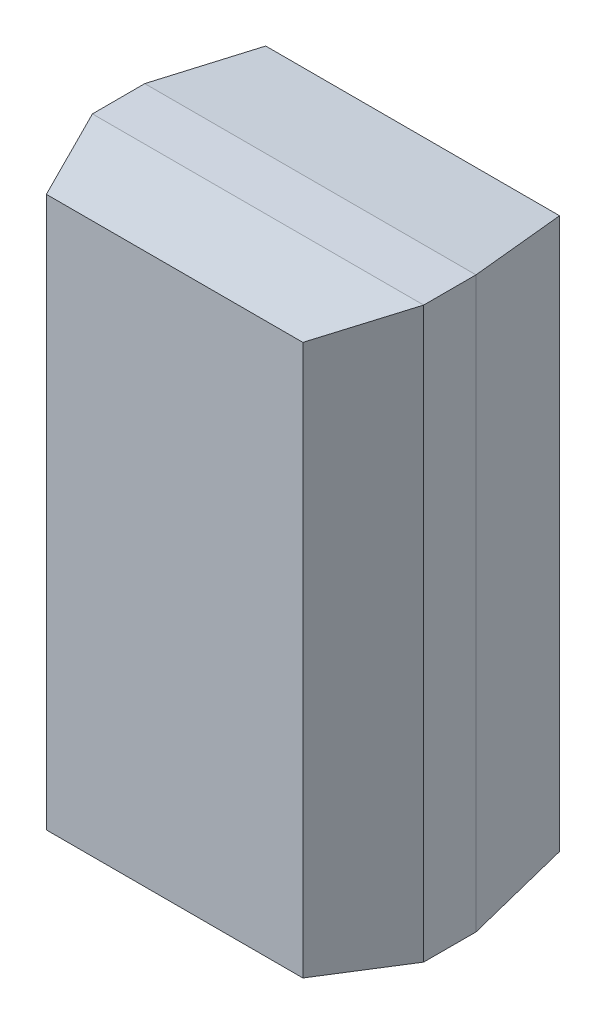
ISO-10303-21;
HEADER;
FILE_DESCRIPTION(('STEP AP214'),'2;1');
FILE_NAME('part.step','',(''),(''),'','','');
FILE_SCHEMA(('AUTOMOTIVE_DESIGN { 1 0 10303 214 1 1 1 1 }'));
ENDSEC;
DATA;
#1=APPLICATION_CONTEXT('core data for automotive mechanical design processes');
#2=APPLICATION_PROTOCOL_DEFINITION('international standard','automotive_design',2000,#1);
#3=PRODUCT_CONTEXT('',#1,'mechanical');
#4=PRODUCT('Part','Part','',(#3));
#5=PRODUCT_RELATED_PRODUCT_CATEGORY('part','',(#4));
#6=PRODUCT_DEFINITION_FORMATION('','',#4);
#7=PRODUCT_DEFINITION_CONTEXT('part definition',#1,'design');
#8=PRODUCT_DEFINITION('design','',#6,#7);
#9=PRODUCT_DEFINITION_SHAPE('','',#8);
#10=(LENGTH_UNIT() NAMED_UNIT(*) SI_UNIT(.MILLI.,.METRE.));
#11=(NAMED_UNIT(*) PLANE_ANGLE_UNIT() SI_UNIT($,.RADIAN.));
#12=(NAMED_UNIT(*) SI_UNIT($,.STERADIAN.) SOLID_ANGLE_UNIT());
#13=UNCERTAINTY_MEASURE_WITH_UNIT(LENGTH_MEASURE(1.E-05),#10,'distance_accuracy_value','');
#14=(GEOMETRIC_REPRESENTATION_CONTEXT(3) GLOBAL_UNCERTAINTY_ASSIGNED_CONTEXT((#13)) GLOBAL_UNIT_ASSIGNED_CONTEXT((#10,
#11,#12)) REPRESENTATION_CONTEXT('',''));
#15=CARTESIAN_POINT('',(0.,0.,0.));
#16=DIRECTION('',(0.,0.,1.));
#17=DIRECTION('',(1.,0.,0.));
#18=AXIS2_PLACEMENT_3D('',#15,#16,#17);
#19=CARTESIAN_POINT('',(-0.698,-1.499,1.448));
#20=DIRECTION('',(0.,0.,-1.));
#21=DIRECTION('',(0.,-1.,0.));
#22=AXIS2_PLACEMENT_3D('',#19,#20,#21);
#23=PLANE('',#22);
#24=CARTESIAN_POINT('',(0.698528639913916,1.49870530014589,1.44820379403079));
#25=CARTESIAN_POINT('',(0.69851631912874,0.499666666666666,1.44823129739721));
#26=CARTESIAN_POINT('',(0.69851631912874,-0.499666666666667,1.44823129739721));
#27=CARTESIAN_POINT('',(0.698534179189156,-1.49857257617505,1.44819142885159));
#28=B_SPLINE_CURVE_WITH_KNOTS('',3,(#24,#25,#26,#27),.UNSPECIFIED.,.F.,.F.,(4,4),(0.,1.),.UNSPECIFIED.);
#29=CARTESIAN_POINT('',(0.698250889717192,1.49870530014589,1.44807936924387));
#30=VERTEX_POINT('',#29);
#31=CARTESIAN_POINT('',(0.698240880171447,-1.49857257617505,1.4480600386016));
#32=VERTEX_POINT('',#31);
#33=EDGE_CURVE('E11',#30,#32,#28,.T.);
#34=ORIENTED_EDGE('',*,*,#33,.F.);
#35=CARTESIAN_POINT('',(-0.698240880171448,1.49829852383897,1.44802943517172));
#36=CARTESIAN_POINT('',(-0.232666666666667,1.49831041018356,1.44792299349132));
#37=CARTESIAN_POINT('',(0.232666666666666,1.49831041018356,1.44792299349132));
#38=CARTESIAN_POINT('',(0.698250889717192,1.49829802648149,1.44803388898557));
#39=B_SPLINE_CURVE_WITH_KNOTS('',3,(#35,#36,#37,#38),.UNSPECIFIED.,.F.,.F.,(4,4),(0.,1.),.UNSPECIFIED.);
#40=CARTESIAN_POINT('',(-0.698240880171447,1.49857257617505,1.4480600386016));
#41=VERTEX_POINT('',#40);
#42=EDGE_CURVE('E25',#41,#30,#39,.T.);
#43=ORIENTED_EDGE('',*,*,#42,.F.);
#44=CARTESIAN_POINT('',(-0.698528639913916,-1.49870530014589,1.44820379403079));
#45=CARTESIAN_POINT('',(-0.69851631912874,-0.499666666666667,1.44823129739721));
#46=CARTESIAN_POINT('',(-0.69851631912874,0.499666666666667,1.44823129739721));
#47=CARTESIAN_POINT('',(-0.698534179189156,1.49857257617505,1.44819142885159));
#48=B_SPLINE_CURVE_WITH_KNOTS('',3,(#44,#45,#46,#47),.UNSPECIFIED.,.F.,.F.,(4,4),(0.,1.),.UNSPECIFIED.);
#49=CARTESIAN_POINT('',(-0.698250889717192,-1.49870530014589,1.44807936924387));
#50=VERTEX_POINT('',#49);
#51=EDGE_CURVE('E511',#50,#41,#48,.T.);
#52=ORIENTED_EDGE('',*,*,#51,.F.);
#53=CARTESIAN_POINT('',(0.698240880171447,-1.49829852383897,1.44802943517172));
#54=CARTESIAN_POINT('',(0.232666666666667,-1.49831041018356,1.44792299349132));
#55=CARTESIAN_POINT('',(-0.232666666666667,-1.49831041018356,1.44792299349132));
#56=CARTESIAN_POINT('',(-0.698250889717192,-1.49829802648149,1.44803388898557));
#57=B_SPLINE_CURVE_WITH_KNOTS('',3,(#53,#54,#55,#56),.UNSPECIFIED.,.F.,.F.,(4,4),(0.,1.),.UNSPECIFIED.);
#58=EDGE_CURVE('E39',#32,#50,#57,.T.);
#59=ORIENTED_EDGE('',*,*,#58,.F.);
#60=EDGE_LOOP('',(#34,#43,#52,#59));
#61=FACE_BOUND('',#60,.T.);
#62=ADVANCED_FACE('F17',(#61),#23,.F.);
#63=CARTESIAN_POINT('',(-0.902,-1.549,0.994));
#64=DIRECTION('',(0.,0.993822618492486,-0.110980191803487));
#65=DIRECTION('',(-1.,0.,0.));
#66=AXIS2_PLACEMENT_3D('',#63,#64,#65);
#67=PLANE('',#66);
#68=CARTESIAN_POINT('',(0.698534179189156,-1.49857257617505,1.44819142885159));
#69=CARTESIAN_POINT('',(0.766372413138729,-1.51499310156649,1.29675791394704));
#70=CARTESIAN_POINT('',(0.834186206569365,-1.53199655078325,1.14537895697352));
#71=CARTESIAN_POINT('',(0.901999426425102,-1.54901130188575,0.994001280376238));
#72=B_SPLINE_CURVE_WITH_KNOTS('',3,(#68,#69,#70,#71),.UNSPECIFIED.,.F.,.F.,(4,4),(0.,1.),.UNSPECIFIED.);
#73=CARTESIAN_POINT('',(0.901770644576754,-1.54901130188575,0.993898792122159));
#74=VERTEX_POINT('',#73);
#75=EDGE_CURVE('E515',#32,#74,#72,.T.);
#76=ORIENTED_EDGE('',*,*,#75,.F.);
#77=ORIENTED_EDGE('',*,*,#58,.T.);
#78=CARTESIAN_POINT('',(-0.901978849710324,-1.54950517382513,0.994047213238324));
#79=CARTESIAN_POINT('',(-0.834143905990011,-1.53300689843351,1.14547338345017));
#80=CARTESIAN_POINT('',(-0.766330112559376,-1.51600344921676,1.29685234042369));
#81=CARTESIAN_POINT('',(-0.698528639913916,-1.49870530014589,1.44820379403079));
#82=B_SPLINE_CURVE_WITH_KNOTS('',3,(#78,#79,#80,#81),.UNSPECIFIED.,.F.,.F.,(4,4),(0.,1.),.UNSPECIFIED.);
#83=CARTESIAN_POINT('',(-0.901978849710324,-1.54950517382514,0.994047213238324));
#84=VERTEX_POINT('',#83);
#85=EDGE_CURVE('E509',#84,#50,#82,.T.);
#86=ORIENTED_EDGE('',*,*,#85,.F.);
#87=CARTESIAN_POINT('',(0.901770644576754,-1.549,0.993898792122159));
#88=CARTESIAN_POINT('',(0.300666666666667,-1.549,0.994));
#89=CARTESIAN_POINT('',(-0.300666666666667,-1.549,0.994));
#90=CARTESIAN_POINT('',(-0.901978849710324,-1.549,0.994047213238324));
#91=B_SPLINE_CURVE_WITH_KNOTS('',3,(#87,#88,#89,#90),.UNSPECIFIED.,.F.,.F.,(4,4),(0.,1.),.UNSPECIFIED.);
#92=EDGE_CURVE('E266',#74,#84,#91,.T.);
#93=ORIENTED_EDGE('',*,*,#92,.F.);
#94=EDGE_LOOP('',(#76,#77,#86,#93));
#95=FACE_BOUND('',#94,.T.);
#96=ADVANCED_FACE('F246',(#95),#67,.F.);
#97=CARTESIAN_POINT('',(0.902,-1.549,0.994));
#98=DIRECTION('',(-0.91261222219085,0.,-0.408826285735003));
#99=DIRECTION('',(-0.408826285735003,0.,0.91261222219085));
#100=AXIS2_PLACEMENT_3D('',#97,#98,#99);
#101=PLANE('',#100);
#102=CARTESIAN_POINT('',(0.698250889717192,1.49829802648149,1.44803388898557));
#103=CARTESIAN_POINT('',(0.766305807230995,1.51519187094137,1.29675027283134));
#104=CARTESIAN_POINT('',(0.834152903615497,1.53209593547068,1.14537513641567));
#105=CARTESIAN_POINT('',(0.901978849710324,1.54900101465903,0.993990913774101));
#106=B_SPLINE_CURVE_WITH_KNOTS('',3,(#102,#103,#104,#105),.UNSPECIFIED.,.F.,.F.,(4,4),(0.,1.),.UNSPECIFIED.);
#107=CARTESIAN_POINT('',(0.901978849710324,1.54950517382513,0.994047213238324));
#108=VERTEX_POINT('',#107);
#109=EDGE_CURVE('E259',#30,#108,#106,.T.);
#110=ORIENTED_EDGE('',*,*,#109,.F.);
#111=ORIENTED_EDGE('',*,*,#33,.T.);
#112=ORIENTED_EDGE('',*,*,#75,.T.);
#113=CARTESIAN_POINT('',(0.902,1.54950517382513,0.994047213238324));
#114=CARTESIAN_POINT('',(0.902,0.516333333333334,0.994));
#115=CARTESIAN_POINT('',(0.902,-0.516333333333333,0.994));
#116=CARTESIAN_POINT('',(0.902,-1.54901130188575,0.993898792122159));
#117=B_SPLINE_CURVE_WITH_KNOTS('',3,(#113,#114,#115,#116),.UNSPECIFIED.,.F.,.F.,(4,4),(0.,1.),.UNSPECIFIED.);
#118=EDGE_CURVE('E262',#108,#74,#117,.T.);
#119=ORIENTED_EDGE('',*,*,#118,.F.);
#120=EDGE_LOOP('',(#110,#111,#112,#119));
#121=FACE_BOUND('',#120,.T.);
#122=ADVANCED_FACE('F250',(#121),#101,.F.);
#123=CARTESIAN_POINT('',(0.902,1.549,0.994));
#124=DIRECTION('',(0.,-0.993822618492486,-0.110980191803487));
#125=DIRECTION('',(0.,0.110980191803487,-0.993822618492486));
#126=AXIS2_PLACEMENT_3D('',#123,#124,#125);
#127=PLANE('',#126);
#128=CARTESIAN_POINT('',(-0.698534179189156,1.49857257617505,1.44819142885159));
#129=CARTESIAN_POINT('',(-0.766372413138729,1.51499310156649,1.29675791394704));
#130=CARTESIAN_POINT('',(-0.834186206569365,1.53199655078325,1.14537895697352));
#131=CARTESIAN_POINT('',(-0.901999426425103,1.54901130188575,0.994001280376238));
#132=B_SPLINE_CURVE_WITH_KNOTS('',3,(#128,#129,#130,#131),.UNSPECIFIED.,.F.,.F.,(4,4),(0.,1.),.UNSPECIFIED.);
#133=CARTESIAN_POINT('',(-0.901770644576755,1.54901130188575,0.993898792122159));
#134=VERTEX_POINT('',#133);
#135=EDGE_CURVE('E557',#41,#134,#132,.T.);
#136=ORIENTED_EDGE('',*,*,#135,.F.);
#137=ORIENTED_EDGE('',*,*,#42,.T.);
#138=ORIENTED_EDGE('',*,*,#109,.T.);
#139=CARTESIAN_POINT('',(-0.901770644576755,1.549,0.993898792122159));
#140=CARTESIAN_POINT('',(-0.300666666666667,1.549,0.994));
#141=CARTESIAN_POINT('',(0.300666666666667,1.549,0.994));
#142=CARTESIAN_POINT('',(0.901978849710324,1.549,0.994047213238324));
#143=B_SPLINE_CURVE_WITH_KNOTS('',3,(#139,#140,#141,#142),.UNSPECIFIED.,.F.,.F.,(4,4),(0.,1.),.UNSPECIFIED.);
#144=EDGE_CURVE('E312',#134,#108,#143,.T.);
#145=ORIENTED_EDGE('',*,*,#144,.F.);
#146=EDGE_LOOP('',(#136,#137,#138,#145));
#147=FACE_BOUND('',#146,.T.);
#148=ADVANCED_FACE('F277',(#147),#127,.F.);
#149=CARTESIAN_POINT('',(-0.902,1.549,0.994));
#150=DIRECTION('',(0.91261222219085,0.,-0.408826285735003));
#151=DIRECTION('',(0.,-1.,0.));
#152=AXIS2_PLACEMENT_3D('',#149,#150,#151);
#153=PLANE('',#152);
#154=ORIENTED_EDGE('',*,*,#85,.T.);
#155=ORIENTED_EDGE('',*,*,#51,.T.);
#156=ORIENTED_EDGE('',*,*,#135,.T.);
#157=CARTESIAN_POINT('',(-0.902,-1.54950517382513,0.994047213238324));
#158=CARTESIAN_POINT('',(-0.902,-0.516333333333334,0.994));
#159=CARTESIAN_POINT('',(-0.902,0.516333333333333,0.994));
#160=CARTESIAN_POINT('',(-0.902,1.54901130188575,0.993898792122159));
#161=B_SPLINE_CURVE_WITH_KNOTS('',3,(#157,#158,#159,#160),.UNSPECIFIED.,.F.,.F.,(4,4),(0.,1.),.UNSPECIFIED.);
#162=EDGE_CURVE('E400',#84,#134,#161,.T.);
#163=ORIENTED_EDGE('',*,*,#162,.F.);
#164=EDGE_LOOP('',(#154,#155,#156,#163));
#165=FACE_BOUND('',#164,.T.);
#166=ADVANCED_FACE('F286',(#165),#153,.F.);
#167=CARTESIAN_POINT('',(-0.902,-1.549,0.709));
#168=DIRECTION('',(0.,1.,0.));
#169=DIRECTION('',(1.,0.,0.));
#170=AXIS2_PLACEMENT_3D('',#167,#168,#169);
#171=PLANE('',#170);
#172=CARTESIAN_POINT('',(0.902,-1.54901130188575,0.993898792122159));
#173=CARTESIAN_POINT('',(0.902,-1.549,0.899));
#174=CARTESIAN_POINT('',(0.902,-1.549,0.804));
#175=CARTESIAN_POINT('',(0.902,-1.54938182720008,0.709002410403475));
#176=B_SPLINE_CURVE_WITH_KNOTS('',3,(#172,#173,#174,#175),.UNSPECIFIED.,.F.,.F.,(4,4),(0.,1.),.UNSPECIFIED.);
#177=CARTESIAN_POINT('',(0.901795414910999,-1.54938182720008,0.709002410403475));
#178=VERTEX_POINT('',#177);
#179=EDGE_CURVE('E403',#74,#178,#176,.T.);
#180=ORIENTED_EDGE('',*,*,#179,.F.);
#181=ORIENTED_EDGE('',*,*,#92,.T.);
#182=CARTESIAN_POINT('',(-0.902,-1.54933731766377,0.709012608410018));
#183=CARTESIAN_POINT('',(-0.902,-1.549,0.804));
#184=CARTESIAN_POINT('',(-0.902,-1.549,0.899));
#185=CARTESIAN_POINT('',(-0.902,-1.54950517382513,0.994047213238324));
#186=B_SPLINE_CURVE_WITH_KNOTS('',3,(#182,#183,#184,#185),.UNSPECIFIED.,.F.,.F.,(4,4),(0.,1.),.UNSPECIFIED.);
#187=CARTESIAN_POINT('',(-0.901761799959485,-1.54933731766377,0.709012608410018));
#188=VERTEX_POINT('',#187);
#189=EDGE_CURVE('E389',#188,#84,#186,.T.);
#190=ORIENTED_EDGE('',*,*,#189,.F.);
#191=CARTESIAN_POINT('',(0.901795414910999,-1.54988656906936,0.708956294429475));
#192=CARTESIAN_POINT('',(0.300666666666667,-1.54988318969266,0.708919306965831));
#193=CARTESIAN_POINT('',(-0.300666666666667,-1.54988318969266,0.708919306965831));
#194=CARTESIAN_POINT('',(-0.901761799959485,-1.54988712462741,0.708962375042858));
#195=B_SPLINE_CURVE_WITH_KNOTS('',3,(#191,#192,#193,#194),.UNSPECIFIED.,.F.,.F.,(4,4),(0.,1.),.UNSPECIFIED.);
#196=EDGE_CURVE('E404',#178,#188,#195,.T.);
#197=ORIENTED_EDGE('',*,*,#196,.F.);
#198=EDGE_LOOP('',(#180,#181,#190,#197));
#199=FACE_BOUND('',#198,.T.);
#200=ADVANCED_FACE('F358',(#199),#171,.F.);
#201=CARTESIAN_POINT('',(0.902,-1.549,0.709));
#202=DIRECTION('',(-1.,0.,0.));
#203=DIRECTION('',(0.,0.,1.));
#204=AXIS2_PLACEMENT_3D('',#201,#202,#203);
#205=PLANE('',#204);
#206=CARTESIAN_POINT('',(0.901978849710324,1.549,0.994047213238324));
#207=CARTESIAN_POINT('',(0.902,1.549,0.899));
#208=CARTESIAN_POINT('',(0.902,1.549,0.804));
#209=CARTESIAN_POINT('',(0.901761799959485,1.549,0.709012608410018));
#210=B_SPLINE_CURVE_WITH_KNOTS('',3,(#206,#207,#208,#209),.UNSPECIFIED.,.F.,.F.,(4,4),(0.,1.),.UNSPECIFIED.);
#211=CARTESIAN_POINT('',(0.901761799959485,1.54933731766377,0.709012608410018));
#212=VERTEX_POINT('',#211);
#213=EDGE_CURVE('E354',#108,#212,#210,.T.);
#214=ORIENTED_EDGE('',*,*,#213,.F.);
#215=ORIENTED_EDGE('',*,*,#118,.T.);
#216=ORIENTED_EDGE('',*,*,#179,.T.);
#217=CARTESIAN_POINT('',(0.901340424521326,1.54933731766377,0.709089261055781));
#218=CARTESIAN_POINT('',(0.901345834287217,0.516333333333334,0.709118999657102));
#219=CARTESIAN_POINT('',(0.901345834287217,-0.516333333333333,0.709118999657102));
#220=CARTESIAN_POINT('',(0.90133970555544,-1.54938182720008,0.709085308751692));
#221=B_SPLINE_CURVE_WITH_KNOTS('',3,(#217,#218,#219,#220),.UNSPECIFIED.,.F.,.F.,(4,4),(0.,1.),.UNSPECIFIED.);
#222=EDGE_CURVE('E407',#212,#178,#221,.T.);
#223=ORIENTED_EDGE('',*,*,#222,.F.);
#224=EDGE_LOOP('',(#214,#215,#216,#223));
#225=FACE_BOUND('',#224,.T.);
#226=ADVANCED_FACE('F325',(#225),#205,.F.);
#227=CARTESIAN_POINT('',(0.902,1.549,0.709));
#228=DIRECTION('',(0.,-1.,0.));
#229=DIRECTION('',(0.,0.,-1.));
#230=AXIS2_PLACEMENT_3D('',#227,#228,#229);
#231=PLANE('',#230);
#232=CARTESIAN_POINT('',(-0.902,1.54901130188575,0.993898792122159));
#233=CARTESIAN_POINT('',(-0.902,1.549,0.899));
#234=CARTESIAN_POINT('',(-0.902,1.549,0.804));
#235=CARTESIAN_POINT('',(-0.902,1.54938182720008,0.709002410403475));
#236=B_SPLINE_CURVE_WITH_KNOTS('',3,(#232,#233,#234,#235),.UNSPECIFIED.,.F.,.F.,(4,4),(0.,1.),.UNSPECIFIED.);
#237=CARTESIAN_POINT('',(-0.901795414910999,1.54938182720008,0.709002410403475));
#238=VERTEX_POINT('',#237);
#239=EDGE_CURVE('E409',#134,#238,#236,.T.);
#240=ORIENTED_EDGE('',*,*,#239,.F.);
#241=ORIENTED_EDGE('',*,*,#144,.T.);
#242=ORIENTED_EDGE('',*,*,#213,.T.);
#243=CARTESIAN_POINT('',(-0.901795414910999,1.54988656906936,0.708956294429475));
#244=CARTESIAN_POINT('',(-0.300666666666667,1.54988318969266,0.708919306965831));
#245=CARTESIAN_POINT('',(0.300666666666667,1.54988318969266,0.708919306965831));
#246=CARTESIAN_POINT('',(0.901761799959485,1.54988712462741,0.708962375042858));
#247=B_SPLINE_CURVE_WITH_KNOTS('',3,(#243,#244,#245,#246),.UNSPECIFIED.,.F.,.F.,(4,4),(0.,1.),.UNSPECIFIED.);
#248=EDGE_CURVE('E411',#238,#212,#247,.T.);
#249=ORIENTED_EDGE('',*,*,#248,.F.);
#250=EDGE_LOOP('',(#240,#241,#242,#249));
#251=FACE_BOUND('',#250,.T.);
#252=ADVANCED_FACE('F316',(#251),#231,.F.);
#253=CARTESIAN_POINT('',(-0.902,1.549,0.709));
#254=DIRECTION('',(1.,0.,0.));
#255=DIRECTION('',(0.,1.,0.));
#256=AXIS2_PLACEMENT_3D('',#253,#254,#255);
#257=PLANE('',#256);
#258=ORIENTED_EDGE('',*,*,#189,.T.);
#259=ORIENTED_EDGE('',*,*,#162,.T.);
#260=ORIENTED_EDGE('',*,*,#239,.T.);
#261=CARTESIAN_POINT('',(-0.901340424521326,-1.54933731766377,0.709089261055781));
#262=CARTESIAN_POINT('',(-0.901345834287217,-0.516333333333334,0.709118999657102));
#263=CARTESIAN_POINT('',(-0.901345834287217,0.516333333333333,0.709118999657102));
#264=CARTESIAN_POINT('',(-0.90133970555544,1.54938182720008,0.709085308751692));
#265=B_SPLINE_CURVE_WITH_KNOTS('',3,(#261,#262,#263,#264),.UNSPECIFIED.,.F.,.F.,(4,4),(0.,1.),.UNSPECIFIED.);
#266=EDGE_CURVE('E110',#188,#238,#265,.T.);
#267=ORIENTED_EDGE('',*,*,#266,.F.);
#268=EDGE_LOOP('',(#258,#259,#260,#267));
#269=FACE_BOUND('',#268,.T.);
#270=ADVANCED_FACE('F171',(#269),#257,.F.);
#271=CARTESIAN_POINT('',(-0.8,-1.499,0.152));
#272=DIRECTION('',(0.,0.995852126937909,0.0909864895093873));
#273=DIRECTION('',(1.,0.,0.));
#274=AXIS2_PLACEMENT_3D('',#271,#272,#273);
#275=PLANE('',#274);
#276=CARTESIAN_POINT('',(0.90133970555544,-1.54938182720008,0.709085308751692));
#277=CARTESIAN_POINT('',(0.867557683961267,-1.53272282700329,0.523378553172554));
#278=CARTESIAN_POINT('',(0.833778841980634,-1.51586141350165,0.337689276586277));
#279=CARTESIAN_POINT('',(0.799999989818543,-1.49899780783946,0.151999944030426));
#280=B_SPLINE_CURVE_WITH_KNOTS('',3,(#276,#277,#278,#279),.UNSPECIFIED.,.F.,.F.,(4,4),(0.,1.),.UNSPECIFIED.);
#281=CARTESIAN_POINT('',(0.80013157836863,-1.49899780783946,0.151976006682392));
#282=VERTEX_POINT('',#281);
#283=EDGE_CURVE('E202',#178,#282,#280,.T.);
#284=ORIENTED_EDGE('',*,*,#283,.F.);
#285=ORIENTED_EDGE('',*,*,#196,.T.);
#286=CARTESIAN_POINT('',(-0.800004654172658,-1.49870787974753,0.152025584949136));
#287=CARTESIAN_POINT('',(-0.833788150325949,-1.51527717299671,0.337740446484548));
#288=CARTESIAN_POINT('',(-0.867566992306583,-1.53213858649835,0.523429723070825));
#289=CARTESIAN_POINT('',(-0.901340424521326,-1.54933731766377,0.709089261055781));
#290=B_SPLINE_CURVE_WITH_KNOTS('',3,(#286,#287,#288,#289),.UNSPECIFIED.,.F.,.F.,(4,4),(0.,1.),.UNSPECIFIED.);
#291=CARTESIAN_POINT('',(-0.800004654172658,-1.49870787974753,0.152025584949136));
#292=VERTEX_POINT('',#291);
#293=EDGE_CURVE('E194',#292,#188,#290,.T.);
#294=ORIENTED_EDGE('',*,*,#293,.F.);
#295=CARTESIAN_POINT('',(0.80013157836863,-1.49899780783946,0.152));
#296=CARTESIAN_POINT('',(0.266666666666667,-1.499,0.152));
#297=CARTESIAN_POINT('',(-0.266666666666667,-1.499,0.152));
#298=CARTESIAN_POINT('',(-0.800004654172658,-1.49870787974753,0.152));
#299=B_SPLINE_CURVE_WITH_KNOTS('',3,(#295,#296,#297,#298),.UNSPECIFIED.,.F.,.F.,(4,4),(0.,1.),.UNSPECIFIED.);
#300=EDGE_CURVE('E117',#282,#292,#299,.T.);
#301=ORIENTED_EDGE('',*,*,#300,.F.);
#302=EDGE_LOOP('',(#284,#285,#294,#301));
#303=FACE_BOUND('',#302,.T.);
#304=ADVANCED_FACE('F162',(#303),#275,.F.);
#305=CARTESIAN_POINT('',(0.8,-1.499,0.152));
#306=DIRECTION('',(-0.983853908541067,0.,0.178973424419564));
#307=DIRECTION('',(0.,1.,0.));
#308=AXIS2_PLACEMENT_3D('',#305,#306,#307);
#309=PLANE('',#308);
#310=CARTESIAN_POINT('',(0.901761799959485,1.54988712462741,0.708962375042858));
#311=CARTESIAN_POINT('',(0.867824562175159,1.5329250493425,0.523311529067365));
#312=CARTESIAN_POINT('',(0.83391228108758,1.51596252467125,0.337655764533682));
#313=CARTESIAN_POINT('',(0.800004654172658,1.49899989989937,0.151998904393095));
#314=B_SPLINE_CURVE_WITH_KNOTS('',3,(#310,#311,#312,#313),.UNSPECIFIED.,.F.,.F.,(4,4),(0.,1.),.UNSPECIFIED.);
#315=CARTESIAN_POINT('',(0.800004654172658,1.49870787974753,0.152025584949136));
#316=VERTEX_POINT('',#315);
#317=EDGE_CURVE('E93',#212,#316,#314,.T.);
#318=ORIENTED_EDGE('',*,*,#317,.F.);
#319=ORIENTED_EDGE('',*,*,#222,.T.);
#320=ORIENTED_EDGE('',*,*,#283,.T.);
#321=CARTESIAN_POINT('',(0.800004654172658,1.49870787974753,0.152));
#322=CARTESIAN_POINT('',(0.8,0.499666666666666,0.152));
#323=CARTESIAN_POINT('',(0.8,-0.499666666666667,0.152));
#324=CARTESIAN_POINT('',(0.80013157836863,-1.49899780783946,0.152));
#325=B_SPLINE_CURVE_WITH_KNOTS('',3,(#321,#322,#323,#324),.UNSPECIFIED.,.F.,.F.,(4,4),(0.,1.),.UNSPECIFIED.);
#326=EDGE_CURVE('E112',#316,#282,#325,.T.);
#327=ORIENTED_EDGE('',*,*,#326,.F.);
#328=EDGE_LOOP('',(#318,#319,#320,#327));
#329=FACE_BOUND('',#328,.T.);
#330=ADVANCED_FACE('F136',(#329),#309,.F.);
#331=CARTESIAN_POINT('',(0.8,1.499,0.152));
#332=DIRECTION('',(0.,-0.995852126937909,0.0909864895093873));
#333=DIRECTION('',(-1.,0.,0.));
#334=AXIS2_PLACEMENT_3D('',#331,#332,#333);
#335=PLANE('',#334);
#336=CARTESIAN_POINT('',(-0.90133970555544,1.54938182720008,0.709085308751692));
#337=CARTESIAN_POINT('',(-0.867557683961267,1.53272282700329,0.523378553172554));
#338=CARTESIAN_POINT('',(-0.833778841980634,1.51586141350165,0.337689276586277));
#339=CARTESIAN_POINT('',(-0.799999989818543,1.49899780783946,0.151999944030426));
#340=B_SPLINE_CURVE_WITH_KNOTS('',3,(#336,#337,#338,#339),.UNSPECIFIED.,.F.,.F.,(4,4),(0.,1.),.UNSPECIFIED.);
#341=CARTESIAN_POINT('',(-0.80013157836863,1.49899780783946,0.151976006682392));
#342=VERTEX_POINT('',#341);
#343=EDGE_CURVE('E90',#238,#342,#340,.T.);
#344=ORIENTED_EDGE('',*,*,#343,.F.);
#345=ORIENTED_EDGE('',*,*,#248,.T.);
#346=ORIENTED_EDGE('',*,*,#317,.T.);
#347=CARTESIAN_POINT('',(-0.80013157836863,1.49899780783946,0.152));
#348=CARTESIAN_POINT('',(-0.266666666666667,1.499,0.152));
#349=CARTESIAN_POINT('',(0.266666666666667,1.499,0.152));
#350=CARTESIAN_POINT('',(0.800004654172658,1.49870787974753,0.152));
#351=B_SPLINE_CURVE_WITH_KNOTS('',3,(#347,#348,#349,#350),.UNSPECIFIED.,.F.,.F.,(4,4),(0.,1.),.UNSPECIFIED.);
#352=EDGE_CURVE('E85',#342,#316,#351,.T.);
#353=ORIENTED_EDGE('',*,*,#352,.F.);
#354=EDGE_LOOP('',(#344,#345,#346,#353));
#355=FACE_BOUND('',#354,.T.);
#356=ADVANCED_FACE('F88',(#355),#335,.F.);
#357=CARTESIAN_POINT('',(-0.8,1.499,0.152));
#358=DIRECTION('',(0.983853908541067,0.,0.178973424419564));
#359=DIRECTION('',(0.,-1.,0.));
#360=AXIS2_PLACEMENT_3D('',#357,#358,#359);
#361=PLANE('',#360);
#362=ORIENTED_EDGE('',*,*,#293,.T.);
#363=ORIENTED_EDGE('',*,*,#266,.T.);
#364=ORIENTED_EDGE('',*,*,#343,.T.);
#365=CARTESIAN_POINT('',(-0.800004654172658,-1.49870787974753,0.152));
#366=CARTESIAN_POINT('',(-0.8,-0.499666666666667,0.152));
#367=CARTESIAN_POINT('',(-0.8,0.499666666666666,0.152));
#368=CARTESIAN_POINT('',(-0.80013157836863,1.49899780783946,0.152));
#369=B_SPLINE_CURVE_WITH_KNOTS('',3,(#365,#366,#367,#368),.UNSPECIFIED.,.F.,.F.,(4,4),(0.,1.),.UNSPECIFIED.);
#370=EDGE_CURVE('E99',#292,#342,#369,.T.);
#371=ORIENTED_EDGE('',*,*,#370,.F.);
#372=EDGE_LOOP('',(#362,#363,#364,#371));
#373=FACE_BOUND('',#372,.T.);
#374=ADVANCED_FACE('F107',(#373),#361,.F.);
#375=CARTESIAN_POINT('',(-0.8,1.499,0.152));
#376=DIRECTION('',(0.,0.,1.));
#377=DIRECTION('',(1.,0.,0.));
#378=AXIS2_PLACEMENT_3D('',#375,#376,#377);
#379=PLANE('',#378);
#380=ORIENTED_EDGE('',*,*,#326,.T.);
#381=ORIENTED_EDGE('',*,*,#300,.T.);
#382=ORIENTED_EDGE('',*,*,#370,.T.);
#383=ORIENTED_EDGE('',*,*,#352,.T.);
#384=EDGE_LOOP('',(#380,#381,#382,#383));
#385=FACE_BOUND('',#384,.T.);
#386=ADVANCED_FACE('F116',(#385),#379,.F.);
#387=CLOSED_SHELL('',(#62,#96,#122,#148,#166,#200,#226,#252,#270,#304,#330,#356,#374,#386));
#388=MANIFOLD_SOLID_BREP('B1',#387);
#389=ADVANCED_BREP_SHAPE_REPRESENTATION('',(#18,#388),#14);
#390=SHAPE_DEFINITION_REPRESENTATION(#9,#389);
ENDSEC;
END-ISO-10303-21;
